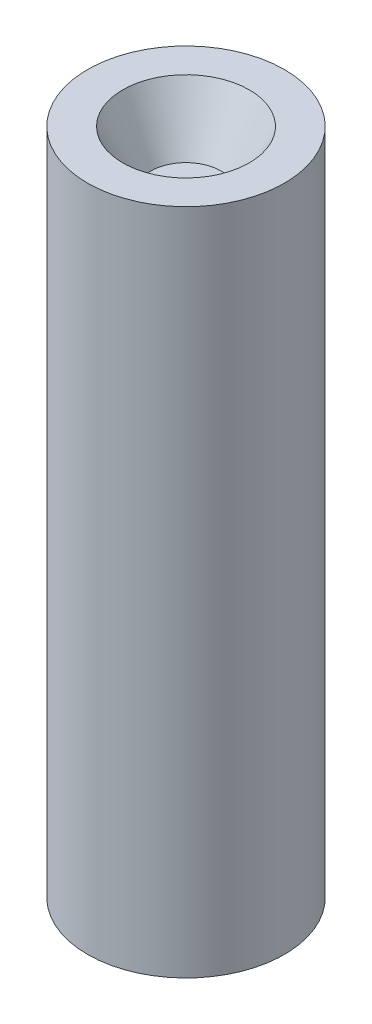
ISO-10303-21;
HEADER;
FILE_DESCRIPTION(('STEP AP214'),'2;1');
FILE_NAME('part.step','',(''),(''),'','','');
FILE_SCHEMA(('AUTOMOTIVE_DESIGN { 1 0 10303 214 1 1 1 1 }'));
ENDSEC;
DATA;
#1=APPLICATION_CONTEXT('core data for automotive mechanical design processes');
#2=APPLICATION_PROTOCOL_DEFINITION('international standard','automotive_design',2000,#1);
#3=PRODUCT_CONTEXT('',#1,'mechanical');
#4=PRODUCT('Part','Part','',(#3));
#5=PRODUCT_RELATED_PRODUCT_CATEGORY('part','',(#4));
#6=PRODUCT_DEFINITION_FORMATION('','',#4);
#7=PRODUCT_DEFINITION_CONTEXT('part definition',#1,'design');
#8=PRODUCT_DEFINITION('design','',#6,#7);
#9=PRODUCT_DEFINITION_SHAPE('','',#8);
#10=(LENGTH_UNIT() NAMED_UNIT(*) SI_UNIT(.MILLI.,.METRE.));
#11=(NAMED_UNIT(*) PLANE_ANGLE_UNIT() SI_UNIT($,.RADIAN.));
#12=(NAMED_UNIT(*) SI_UNIT($,.STERADIAN.) SOLID_ANGLE_UNIT());
#13=UNCERTAINTY_MEASURE_WITH_UNIT(LENGTH_MEASURE(1.E-05),#10,'distance_accuracy_value','');
#14=(GEOMETRIC_REPRESENTATION_CONTEXT(3) GLOBAL_UNCERTAINTY_ASSIGNED_CONTEXT((#13)) GLOBAL_UNIT_ASSIGNED_CONTEXT((#10,
#11,#12)) REPRESENTATION_CONTEXT('',''));
#15=CARTESIAN_POINT('',(0.,0.,0.));
#16=DIRECTION('',(0.,0.,1.));
#17=DIRECTION('',(1.,0.,0.));
#18=AXIS2_PLACEMENT_3D('',#15,#16,#17);
#19=CARTESIAN_POINT('',(0.,0.,0.));
#20=DIRECTION('',(0.,-1.,0.));
#21=DIRECTION('',(0.,0.,-1.));
#22=AXIS2_PLACEMENT_3D('',#19,#20,#21);
#23=PLANE('',#22);
#24=CARTESIAN_POINT('',(0.,0.,0.));
#25=DIRECTION('',(0.,-1.,0.));
#26=DIRECTION('',(0.,0.,-1.));
#27=AXIS2_PLACEMENT_3D('',#24,#25,#26);
#28=CIRCLE('',#27,1.4);
#29=CARTESIAN_POINT('',(0.,0.,-1.4));
#30=VERTEX_POINT('',#29);
#31=EDGE_CURVE('E10',#30,#30,#28,.T.);
#32=ORIENTED_EDGE('',*,*,#31,.T.);
#33=EDGE_LOOP('',(#32));
#34=FACE_BOUND('',#33,.T.);
#35=ADVANCED_FACE('F43',(#34),#23,.T.);
#36=CARTESIAN_POINT('',(0.,0.,0.));
#37=DIRECTION('',(0.,-1.,0.));
#38=DIRECTION('',(0.,0.,-1.));
#39=AXIS2_PLACEMENT_3D('',#36,#37,#38);
#40=CYLINDRICAL_SURFACE('',#39,1.4);
#41=CARTESIAN_POINT('',(0.,9.5,0.));
#42=DIRECTION('',(0.,-1.,0.));
#43=DIRECTION('',(0.,0.,-1.));
#44=AXIS2_PLACEMENT_3D('',#41,#42,#43);
#45=CIRCLE('',#44,1.4);
#46=CARTESIAN_POINT('',(0.,9.5,-1.4));
#47=VERTEX_POINT('',#46);
#48=EDGE_CURVE('E50',#47,#47,#45,.T.);
#49=ORIENTED_EDGE('',*,*,#48,.T.);
#50=EDGE_LOOP('',(#49));
#51=FACE_BOUND('',#50,.T.);
#52=ORIENTED_EDGE('',*,*,#31,.F.);
#53=EDGE_LOOP('',(#52));
#54=FACE_BOUND('',#53,.T.);
#55=ADVANCED_FACE('F79',(#51,#54),#40,.T.);
#56=CARTESIAN_POINT('',(1.4,9.5,0.));
#57=DIRECTION('',(0.,1.,0.));
#58=DIRECTION('',(0.,0.,1.));
#59=AXIS2_PLACEMENT_3D('',#56,#57,#58);
#60=PLANE('',#59);
#61=CARTESIAN_POINT('',(0.,9.5,0.));
#62=DIRECTION('',(0.,-1.,0.));
#63=DIRECTION('',(0.,0.,-1.));
#64=AXIS2_PLACEMENT_3D('',#61,#62,#63);
#65=CIRCLE('',#64,0.9);
#66=CARTESIAN_POINT('',(0.,9.5,-0.9));
#67=VERTEX_POINT('',#66);
#68=EDGE_CURVE('E55',#67,#67,#65,.T.);
#69=ORIENTED_EDGE('',*,*,#68,.T.);
#70=EDGE_LOOP('',(#69));
#71=FACE_BOUND('',#70,.T.);
#72=ORIENTED_EDGE('',*,*,#48,.F.);
#73=EDGE_LOOP('',(#72));
#74=FACE_BOUND('',#73,.T.);
#75=ADVANCED_FACE('F76',(#71,#74),#60,.T.);
#76=CARTESIAN_POINT('',(0.,9.5,0.));
#77=DIRECTION('',(0.,1.,0.));
#78=DIRECTION('',(0.,0.,1.));
#79=AXIS2_PLACEMENT_3D('',#76,#77,#78);
#80=CONICAL_SURFACE('',#79,0.9,0.463647609000806);
#81=CARTESIAN_POINT('',(0.,8.7,0.));
#82=DIRECTION('',(0.,-1.,0.));
#83=DIRECTION('',(0.,0.,-1.));
#84=AXIS2_PLACEMENT_3D('',#81,#82,#83);
#85=CIRCLE('',#84,0.5);
#86=CARTESIAN_POINT('',(0.,8.7,-0.5));
#87=VERTEX_POINT('',#86);
#88=EDGE_CURVE('E60',#87,#87,#85,.T.);
#89=ORIENTED_EDGE('',*,*,#88,.T.);
#90=EDGE_LOOP('',(#89));
#91=FACE_BOUND('',#90,.T.);
#92=ORIENTED_EDGE('',*,*,#68,.F.);
#93=EDGE_LOOP('',(#92));
#94=FACE_BOUND('',#93,.T.);
#95=ADVANCED_FACE('F67',(#91,#94),#80,.F.);
#96=CARTESIAN_POINT('',(0.5,8.7,0.));
#97=DIRECTION('',(0.,1.,0.));
#98=DIRECTION('',(0.,0.,1.));
#99=AXIS2_PLACEMENT_3D('',#96,#97,#98);
#100=PLANE('',#99);
#101=ORIENTED_EDGE('',*,*,#88,.F.);
#102=EDGE_LOOP('',(#101));
#103=FACE_BOUND('',#102,.T.);
#104=ADVANCED_FACE('F70',(#103),#100,.T.);
#105=CLOSED_SHELL('',(#35,#55,#75,#95,#104));
#106=MANIFOLD_SOLID_BREP('B2',#105);
#107=ADVANCED_BREP_SHAPE_REPRESENTATION('',(#18,#106),#14);
#108=SHAPE_DEFINITION_REPRESENTATION(#9,#107);
ENDSEC;
END-ISO-10303-21;
